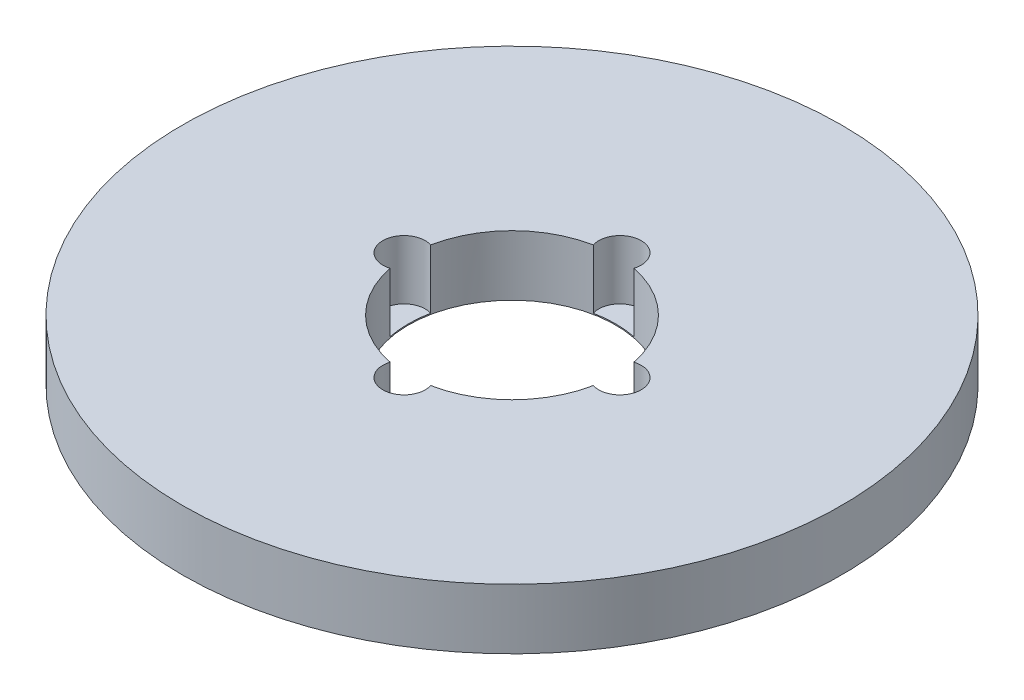
ISO-10303-21;
HEADER;
FILE_DESCRIPTION(('STEP AP214'),'2;1');
FILE_NAME('part.step','',(''),(''),'','','');
FILE_SCHEMA(('AUTOMOTIVE_DESIGN { 1 0 10303 214 1 1 1 1 }'));
ENDSEC;
DATA;
#1=APPLICATION_CONTEXT('core data for automotive mechanical design processes');
#2=APPLICATION_PROTOCOL_DEFINITION('international standard','automotive_design',2000,#1);
#3=PRODUCT_CONTEXT('',#1,'mechanical');
#4=PRODUCT('Part','Part','',(#3));
#5=PRODUCT_RELATED_PRODUCT_CATEGORY('part','',(#4));
#6=PRODUCT_DEFINITION_FORMATION('','',#4);
#7=PRODUCT_DEFINITION_CONTEXT('part definition',#1,'design');
#8=PRODUCT_DEFINITION('design','',#6,#7);
#9=PRODUCT_DEFINITION_SHAPE('','',#8);
#10=(LENGTH_UNIT() NAMED_UNIT(*) SI_UNIT(.MILLI.,.METRE.));
#11=(NAMED_UNIT(*) PLANE_ANGLE_UNIT() SI_UNIT($,.RADIAN.));
#12=(NAMED_UNIT(*) SI_UNIT($,.STERADIAN.) SOLID_ANGLE_UNIT());
#13=UNCERTAINTY_MEASURE_WITH_UNIT(LENGTH_MEASURE(1.E-05),#10,'distance_accuracy_value','');
#14=(GEOMETRIC_REPRESENTATION_CONTEXT(3) GLOBAL_UNCERTAINTY_ASSIGNED_CONTEXT((#13)) GLOBAL_UNIT_ASSIGNED_CONTEXT((#10,
#11,#12)) REPRESENTATION_CONTEXT('',''));
#15=CARTESIAN_POINT('',(0.,0.,0.));
#16=DIRECTION('',(0.,0.,1.));
#17=DIRECTION('',(1.,0.,0.));
#18=AXIS2_PLACEMENT_3D('',#15,#16,#17);
#19=CARTESIAN_POINT('',(0.,16.,0.));
#20=DIRECTION('',(0.,-1.,0.));
#21=DIRECTION('',(0.,0.,-1.));
#22=AXIS2_PLACEMENT_3D('',#19,#20,#21);
#23=CYLINDRICAL_SURFACE('',#22,87.5);
#24=CARTESIAN_POINT('',(0.,16.,0.));
#25=DIRECTION('',(0.,1.,0.));
#26=DIRECTION('',(0.,0.,1.));
#27=AXIS2_PLACEMENT_3D('',#24,#25,#26);
#28=CIRCLE('',#27,87.5);
#29=CARTESIAN_POINT('',(0.,16.,87.5));
#30=VERTEX_POINT('',#29);
#31=EDGE_CURVE('E145',#30,#30,#28,.T.);
#32=ORIENTED_EDGE('',*,*,#31,.F.);
#33=EDGE_LOOP('',(#32));
#34=FACE_BOUND('',#33,.T.);
#35=CARTESIAN_POINT('',(0.,0.,0.));
#36=DIRECTION('',(0.,1.,0.));
#37=DIRECTION('',(0.,0.,1.));
#38=AXIS2_PLACEMENT_3D('',#35,#36,#37);
#39=CIRCLE('',#38,87.5);
#40=CARTESIAN_POINT('',(0.,0.,87.5));
#41=VERTEX_POINT('',#40);
#42=EDGE_CURVE('E143',#41,#41,#39,.T.);
#43=ORIENTED_EDGE('',*,*,#42,.T.);
#44=EDGE_LOOP('',(#43));
#45=FACE_BOUND('',#44,.T.);
#46=ADVANCED_FACE('F39',(#34,#45),#23,.T.);
#47=CARTESIAN_POINT('',(0.,16.,0.));
#48=DIRECTION('',(0.,1.,0.));
#49=DIRECTION('',(0.,0.,1.));
#50=AXIS2_PLACEMENT_3D('',#47,#48,#49);
#51=PLANE('',#50);
#52=CARTESIAN_POINT('',(1.00081220718264E-13,16.,28.6644008675769));
#53=DIRECTION('',(0.,1.,0.));
#54=DIRECTION('',(1.,0.,0.));
#55=AXIS2_PLACEMENT_3D('',#52,#53,#54);
#56=CIRCLE('',#55,5.64141118195077);
#57=CARTESIAN_POINT('',(-5.38047153505129,16.,26.9685098969243));
#58=VERTEX_POINT('',#57);
#59=CARTESIAN_POINT('',(5.38047153505148,16.,26.9685098969242));
#60=VERTEX_POINT('',#59);
#61=EDGE_CURVE('E152',#58,#60,#56,.T.);
#62=ORIENTED_EDGE('',*,*,#61,.F.);
#63=CARTESIAN_POINT('',(0.,16.,0.));
#64=DIRECTION('',(0.,1.,0.));
#65=DIRECTION('',(0.,0.,1.));
#66=AXIS2_PLACEMENT_3D('',#63,#64,#65);
#67=CIRCLE('',#66,27.5);
#68=CARTESIAN_POINT('',(-26.9685098969243,16.,5.38047153505138));
#69=VERTEX_POINT('',#68);
#70=EDGE_CURVE('E133',#69,#58,#67,.T.);
#71=ORIENTED_EDGE('',*,*,#70,.F.);
#72=CARTESIAN_POINT('',(-28.6644008675769,16.,0.));
#73=DIRECTION('',(0.,1.,0.));
#74=DIRECTION('',(0.,0.,1.));
#75=AXIS2_PLACEMENT_3D('',#72,#73,#74);
#76=CIRCLE('',#75,5.64141118195077);
#77=CARTESIAN_POINT('',(-26.9685098969243,16.,-5.38047153505138));
#78=VERTEX_POINT('',#77);
#79=EDGE_CURVE('E128',#78,#69,#76,.T.);
#80=ORIENTED_EDGE('',*,*,#79,.F.);
#81=CARTESIAN_POINT('',(-5.38047153505166,16.,-26.9685098969242));
#82=VERTEX_POINT('',#81);
#83=EDGE_CURVE('E121',#82,#78,#67,.T.);
#84=ORIENTED_EDGE('',*,*,#83,.F.);
#85=CARTESIAN_POINT('',(-3.00243662154791E-13,16.,-28.6644008675769));
#86=DIRECTION('',(0.,1.,0.));
#87=DIRECTION('',(-1.,0.,0.));
#88=AXIS2_PLACEMENT_3D('',#85,#86,#87);
#89=CIRCLE('',#88,5.64141118195077);
#90=CARTESIAN_POINT('',(5.3804715350511,16.,-26.9685098969243));
#91=VERTEX_POINT('',#90);
#92=EDGE_CURVE('E105',#91,#82,#89,.T.);
#93=ORIENTED_EDGE('',*,*,#92,.F.);
#94=CARTESIAN_POINT('',(26.9685098969243,16.,-5.38047153505138));
#95=VERTEX_POINT('',#94);
#96=EDGE_CURVE('E131',#95,#91,#67,.T.);
#97=ORIENTED_EDGE('',*,*,#96,.F.);
#98=CARTESIAN_POINT('',(28.6644008675769,16.,0.));
#99=DIRECTION('',(0.,1.,0.));
#100=DIRECTION('',(0.,0.,-1.));
#101=AXIS2_PLACEMENT_3D('',#98,#99,#100);
#102=CIRCLE('',#101,5.64141118195077);
#103=CARTESIAN_POINT('',(26.9685098969243,16.,5.38047153505138));
#104=VERTEX_POINT('',#103);
#105=EDGE_CURVE('E154',#104,#95,#102,.T.);
#106=ORIENTED_EDGE('',*,*,#105,.F.);
#107=EDGE_CURVE('E134',#60,#104,#67,.T.);
#108=ORIENTED_EDGE('',*,*,#107,.F.);
#109=EDGE_LOOP('',(#62,#71,#80,#84,#93,#97,#106,#108));
#110=FACE_BOUND('',#109,.T.);
#111=ORIENTED_EDGE('',*,*,#31,.T.);
#112=EDGE_LOOP('',(#111));
#113=FACE_BOUND('',#112,.T.);
#114=ADVANCED_FACE('F130',(#110,#113),#51,.T.);
#115=CARTESIAN_POINT('',(0.,0.,0.));
#116=DIRECTION('',(0.,1.,0.));
#117=DIRECTION('',(0.,0.,1.));
#118=AXIS2_PLACEMENT_3D('',#115,#116,#117);
#119=PLANE('',#118);
#120=CARTESIAN_POINT('',(0.,0.,0.));
#121=DIRECTION('',(0.,1.,0.));
#122=DIRECTION('',(0.,0.,1.));
#123=AXIS2_PLACEMENT_3D('',#120,#121,#122);
#124=CIRCLE('',#123,27.5);
#125=CARTESIAN_POINT('',(0.,0.,27.5));
#126=VERTEX_POINT('',#125);
#127=EDGE_CURVE('E135',#126,#126,#124,.T.);
#128=ORIENTED_EDGE('',*,*,#127,.T.);
#129=EDGE_LOOP('',(#128));
#130=FACE_BOUND('',#129,.T.);
#131=ORIENTED_EDGE('',*,*,#42,.F.);
#132=EDGE_LOOP('',(#131));
#133=FACE_BOUND('',#132,.T.);
#134=ADVANCED_FACE('F195',(#130,#133),#119,.F.);
#135=CARTESIAN_POINT('',(0.,16.,0.));
#136=DIRECTION('',(0.,-1.,0.));
#137=DIRECTION('',(0.,0.,-1.));
#138=AXIS2_PLACEMENT_3D('',#135,#136,#137);
#139=CYLINDRICAL_SURFACE('',#138,27.5);
#140=DIRECTION('',(0.,1.,0.));
#141=VECTOR('',#140,1.);
#142=CARTESIAN_POINT('',(-5.38047153505129,8.14260801460465,26.9685098969243));
#143=LINE('',#142,#141);
#144=CARTESIAN_POINT('',(-5.38047153505129,0.285216029209296,26.9685098969243));
#145=VERTEX_POINT('',#144);
#146=EDGE_CURVE('E11',#145,#58,#143,.T.);
#147=ORIENTED_EDGE('',*,*,#146,.F.);
#148=CARTESIAN_POINT('',(0.,0.285216029209296,0.));
#149=DIRECTION('',(0.,1.,0.));
#150=DIRECTION('',(0.,0.,1.));
#151=AXIS2_PLACEMENT_3D('',#148,#149,#150);
#152=CIRCLE('',#151,27.5);
#153=CARTESIAN_POINT('',(5.38047153505148,0.285216029209296,26.9685098969242));
#154=VERTEX_POINT('',#153);
#155=EDGE_CURVE('E169',#145,#154,#152,.T.);
#156=ORIENTED_EDGE('',*,*,#155,.T.);
#157=DIRECTION('',(0.,1.,0.));
#158=VECTOR('',#157,1.);
#159=CARTESIAN_POINT('',(5.38047153505148,8.14260801460465,26.9685098969242));
#160=LINE('',#159,#158);
#161=EDGE_CURVE('E46',#60,#154,#160,.F.);
#162=ORIENTED_EDGE('',*,*,#161,.F.);
#163=ORIENTED_EDGE('',*,*,#107,.T.);
#164=DIRECTION('',(0.,1.,0.));
#165=VECTOR('',#164,1.);
#166=CARTESIAN_POINT('',(26.9685098969243,8.14260801460465,5.38047153505138));
#167=LINE('',#166,#165);
#168=CARTESIAN_POINT('',(26.9685098969243,0.285216029209296,5.38047153505138));
#169=VERTEX_POINT('',#168);
#170=EDGE_CURVE('E151',#169,#104,#167,.T.);
#171=ORIENTED_EDGE('',*,*,#170,.F.);
#172=CARTESIAN_POINT('',(0.,0.285216029209296,0.));
#173=DIRECTION('',(0.,1.,0.));
#174=DIRECTION('',(0.,0.,1.));
#175=AXIS2_PLACEMENT_3D('',#172,#173,#174);
#176=CIRCLE('',#175,27.5);
#177=CARTESIAN_POINT('',(26.9685098969243,0.285216029209296,-5.38047153505138));
#178=VERTEX_POINT('',#177);
#179=EDGE_CURVE('E173',#169,#178,#176,.T.);
#180=ORIENTED_EDGE('',*,*,#179,.T.);
#181=DIRECTION('',(0.,1.,0.));
#182=VECTOR('',#181,1.);
#183=CARTESIAN_POINT('',(26.9685098969243,8.14260801460465,-5.38047153505138));
#184=LINE('',#183,#182);
#185=EDGE_CURVE('E168',#95,#178,#184,.F.);
#186=ORIENTED_EDGE('',*,*,#185,.F.);
#187=ORIENTED_EDGE('',*,*,#96,.T.);
#188=DIRECTION('',(0.,1.,0.));
#189=VECTOR('',#188,1.);
#190=CARTESIAN_POINT('',(5.3804715350511,8.14260801460465,-26.9685098969243));
#191=LINE('',#190,#189);
#192=CARTESIAN_POINT('',(5.3804715350511,0.285216029209296,-26.9685098969243));
#193=VERTEX_POINT('',#192);
#194=EDGE_CURVE('E108',#193,#91,#191,.T.);
#195=ORIENTED_EDGE('',*,*,#194,.F.);
#196=CARTESIAN_POINT('',(0.,0.285216029209296,0.));
#197=DIRECTION('',(0.,1.,0.));
#198=DIRECTION('',(0.,0.,1.));
#199=AXIS2_PLACEMENT_3D('',#196,#197,#198);
#200=CIRCLE('',#199,27.5);
#201=CARTESIAN_POINT('',(-5.38047153505166,0.285216029209296,-26.9685098969242));
#202=VERTEX_POINT('',#201);
#203=EDGE_CURVE('E122',#193,#202,#200,.T.);
#204=ORIENTED_EDGE('',*,*,#203,.T.);
#205=DIRECTION('',(0.,1.,0.));
#206=VECTOR('',#205,1.);
#207=CARTESIAN_POINT('',(-5.38047153505167,8.14260801460465,-26.9685098969242));
#208=LINE('',#207,#206);
#209=EDGE_CURVE('E106',#82,#202,#208,.F.);
#210=ORIENTED_EDGE('',*,*,#209,.F.);
#211=ORIENTED_EDGE('',*,*,#83,.T.);
#212=DIRECTION('',(0.,1.,0.));
#213=VECTOR('',#212,1.);
#214=CARTESIAN_POINT('',(-26.9685098969243,8.14260801460465,-5.38047153505138));
#215=LINE('',#214,#213);
#216=CARTESIAN_POINT('',(-26.9685098969243,0.285216029209296,-5.38047153505138));
#217=VERTEX_POINT('',#216);
#218=EDGE_CURVE('E177',#217,#78,#215,.T.);
#219=ORIENTED_EDGE('',*,*,#218,.F.);
#220=CARTESIAN_POINT('',(0.,0.285216029209296,0.));
#221=DIRECTION('',(0.,1.,0.));
#222=DIRECTION('',(0.,0.,1.));
#223=AXIS2_PLACEMENT_3D('',#220,#221,#222);
#224=CIRCLE('',#223,27.5);
#225=CARTESIAN_POINT('',(-26.9685098969243,0.285216029209296,5.38047153505138));
#226=VERTEX_POINT('',#225);
#227=EDGE_CURVE('E185',#217,#226,#224,.T.);
#228=ORIENTED_EDGE('',*,*,#227,.T.);
#229=DIRECTION('',(0.,1.,0.));
#230=VECTOR('',#229,1.);
#231=CARTESIAN_POINT('',(-26.9685098969243,8.14260801460465,5.38047153505138));
#232=LINE('',#231,#230);
#233=EDGE_CURVE('E179',#69,#226,#232,.F.);
#234=ORIENTED_EDGE('',*,*,#233,.F.);
#235=ORIENTED_EDGE('',*,*,#70,.T.);
#236=EDGE_LOOP('',(#147,#156,#162,#163,#171,#180,#186,#187,#195,#204,#210,#211,#219,#228,#234,#235));
#237=FACE_BOUND('',#236,.T.);
#238=ORIENTED_EDGE('',*,*,#127,.F.);
#239=EDGE_LOOP('',(#238));
#240=FACE_BOUND('',#239,.T.);
#241=ADVANCED_FACE('F117',(#237,#240),#139,.F.);
#242=CARTESIAN_POINT('',(-28.6644008675769,0.285216029209296,0.));
#243=DIRECTION('',(0.,1.,0.));
#244=DIRECTION('',(0.,0.,1.));
#245=AXIS2_PLACEMENT_3D('',#242,#243,#244);
#246=CYLINDRICAL_SURFACE('',#245,5.64141118195077);
#247=ORIENTED_EDGE('',*,*,#218,.T.);
#248=ORIENTED_EDGE('',*,*,#79,.T.);
#249=ORIENTED_EDGE('',*,*,#233,.T.);
#250=CARTESIAN_POINT('',(-28.6644008675769,0.285216029209296,0.));
#251=DIRECTION('',(0.,1.,0.));
#252=DIRECTION('',(0.,0.,1.));
#253=AXIS2_PLACEMENT_3D('',#250,#251,#252);
#254=CIRCLE('',#253,5.64141118195077);
#255=EDGE_CURVE('E140',#217,#226,#254,.T.);
#256=ORIENTED_EDGE('',*,*,#255,.F.);
#257=EDGE_LOOP('',(#247,#248,#249,#256));
#258=FACE_BOUND('',#257,.T.);
#259=ADVANCED_FACE('F200',(#258),#246,.F.);
#260=CARTESIAN_POINT('',(-28.6644008675769,0.285216029209296,0.));
#261=DIRECTION('',(0.,1.,0.));
#262=DIRECTION('',(0.,0.,1.));
#263=AXIS2_PLACEMENT_3D('',#260,#261,#262);
#264=PLANE('',#263);
#265=ORIENTED_EDGE('',*,*,#255,.T.);
#266=ORIENTED_EDGE('',*,*,#227,.F.);
#267=EDGE_LOOP('',(#265,#266));
#268=FACE_BOUND('',#267,.T.);
#269=ADVANCED_FACE('F202',(#268),#264,.T.);
#270=CARTESIAN_POINT('',(-3.00243662154791E-13,0.285216029209296,-28.6644008675769));
#271=DIRECTION('',(0.,1.,0.));
#272=DIRECTION('',(0.,0.,1.));
#273=AXIS2_PLACEMENT_3D('',#270,#271,#272);
#274=CYLINDRICAL_SURFACE('',#273,5.64141118195077);
#275=ORIENTED_EDGE('',*,*,#194,.T.);
#276=ORIENTED_EDGE('',*,*,#92,.T.);
#277=ORIENTED_EDGE('',*,*,#209,.T.);
#278=CARTESIAN_POINT('',(-3.00243662154791E-13,0.285216029209296,-28.6644008675769));
#279=DIRECTION('',(0.,1.,0.));
#280=DIRECTION('',(-1.,0.,0.));
#281=AXIS2_PLACEMENT_3D('',#278,#279,#280);
#282=CIRCLE('',#281,5.64141118195077);
#283=EDGE_CURVE('E111',#193,#202,#282,.T.);
#284=ORIENTED_EDGE('',*,*,#283,.F.);
#285=EDGE_LOOP('',(#275,#276,#277,#284));
#286=FACE_BOUND('',#285,.T.);
#287=ADVANCED_FACE('F102',(#286),#274,.F.);
#288=CARTESIAN_POINT('',(-3.00243662154791E-13,0.285216029209296,-28.6644008675769));
#289=DIRECTION('',(0.,1.,0.));
#290=DIRECTION('',(-1.,0.,0.));
#291=AXIS2_PLACEMENT_3D('',#288,#289,#290);
#292=PLANE('',#291);
#293=ORIENTED_EDGE('',*,*,#283,.T.);
#294=ORIENTED_EDGE('',*,*,#203,.F.);
#295=EDGE_LOOP('',(#293,#294));
#296=FACE_BOUND('',#295,.T.);
#297=ADVANCED_FACE('F211',(#296),#292,.T.);
#298=CARTESIAN_POINT('',(28.6644008675769,0.285216029209296,0.));
#299=DIRECTION('',(0.,1.,0.));
#300=DIRECTION('',(0.,0.,1.));
#301=AXIS2_PLACEMENT_3D('',#298,#299,#300);
#302=CYLINDRICAL_SURFACE('',#301,5.64141118195077);
#303=ORIENTED_EDGE('',*,*,#170,.T.);
#304=ORIENTED_EDGE('',*,*,#105,.T.);
#305=ORIENTED_EDGE('',*,*,#185,.T.);
#306=CARTESIAN_POINT('',(28.6644008675769,0.285216029209296,0.));
#307=DIRECTION('',(0.,1.,0.));
#308=DIRECTION('',(0.,0.,-1.));
#309=AXIS2_PLACEMENT_3D('',#306,#307,#308);
#310=CIRCLE('',#309,5.64141118195077);
#311=EDGE_CURVE('E56',#169,#178,#310,.T.);
#312=ORIENTED_EDGE('',*,*,#311,.F.);
#313=EDGE_LOOP('',(#303,#304,#305,#312));
#314=FACE_BOUND('',#313,.T.);
#315=ADVANCED_FACE('F212',(#314),#302,.F.);
#316=CARTESIAN_POINT('',(28.6644008675769,0.285216029209296,0.));
#317=DIRECTION('',(0.,1.,0.));
#318=DIRECTION('',(0.,0.,-1.));
#319=AXIS2_PLACEMENT_3D('',#316,#317,#318);
#320=PLANE('',#319);
#321=ORIENTED_EDGE('',*,*,#311,.T.);
#322=ORIENTED_EDGE('',*,*,#179,.F.);
#323=EDGE_LOOP('',(#321,#322));
#324=FACE_BOUND('',#323,.T.);
#325=ADVANCED_FACE('F217',(#324),#320,.T.);
#326=CARTESIAN_POINT('',(1.00081220718264E-13,0.285216029209296,28.6644008675769));
#327=DIRECTION('',(0.,1.,0.));
#328=DIRECTION('',(0.,0.,1.));
#329=AXIS2_PLACEMENT_3D('',#326,#327,#328);
#330=CYLINDRICAL_SURFACE('',#329,5.64141118195077);
#331=ORIENTED_EDGE('',*,*,#146,.T.);
#332=ORIENTED_EDGE('',*,*,#61,.T.);
#333=ORIENTED_EDGE('',*,*,#161,.T.);
#334=CARTESIAN_POINT('',(1.00081220718264E-13,0.285216029209296,28.6644008675769));
#335=DIRECTION('',(0.,1.,0.));
#336=DIRECTION('',(1.,0.,0.));
#337=AXIS2_PLACEMENT_3D('',#334,#335,#336);
#338=CIRCLE('',#337,5.64141118195077);
#339=EDGE_CURVE('E55',#145,#154,#338,.T.);
#340=ORIENTED_EDGE('',*,*,#339,.F.);
#341=EDGE_LOOP('',(#331,#332,#333,#340));
#342=FACE_BOUND('',#341,.T.);
#343=ADVANCED_FACE('F170',(#342),#330,.F.);
#344=CARTESIAN_POINT('',(1.00081220718264E-13,0.285216029209296,28.6644008675769));
#345=DIRECTION('',(0.,1.,0.));
#346=DIRECTION('',(1.,0.,0.));
#347=AXIS2_PLACEMENT_3D('',#344,#345,#346);
#348=PLANE('',#347);
#349=ORIENTED_EDGE('',*,*,#339,.T.);
#350=ORIENTED_EDGE('',*,*,#155,.F.);
#351=EDGE_LOOP('',(#349,#350));
#352=FACE_BOUND('',#351,.T.);
#353=ADVANCED_FACE('F224',(#352),#348,.T.);
#354=CLOSED_SHELL('',(#46,#114,#134,#241,#259,#269,#287,#297,#315,#325,#343,#353));
#355=MANIFOLD_SOLID_BREP('B2',#354);
#356=ADVANCED_BREP_SHAPE_REPRESENTATION('',(#18,#355),#14);
#357=SHAPE_DEFINITION_REPRESENTATION(#9,#356);
ENDSEC;
END-ISO-10303-21;
